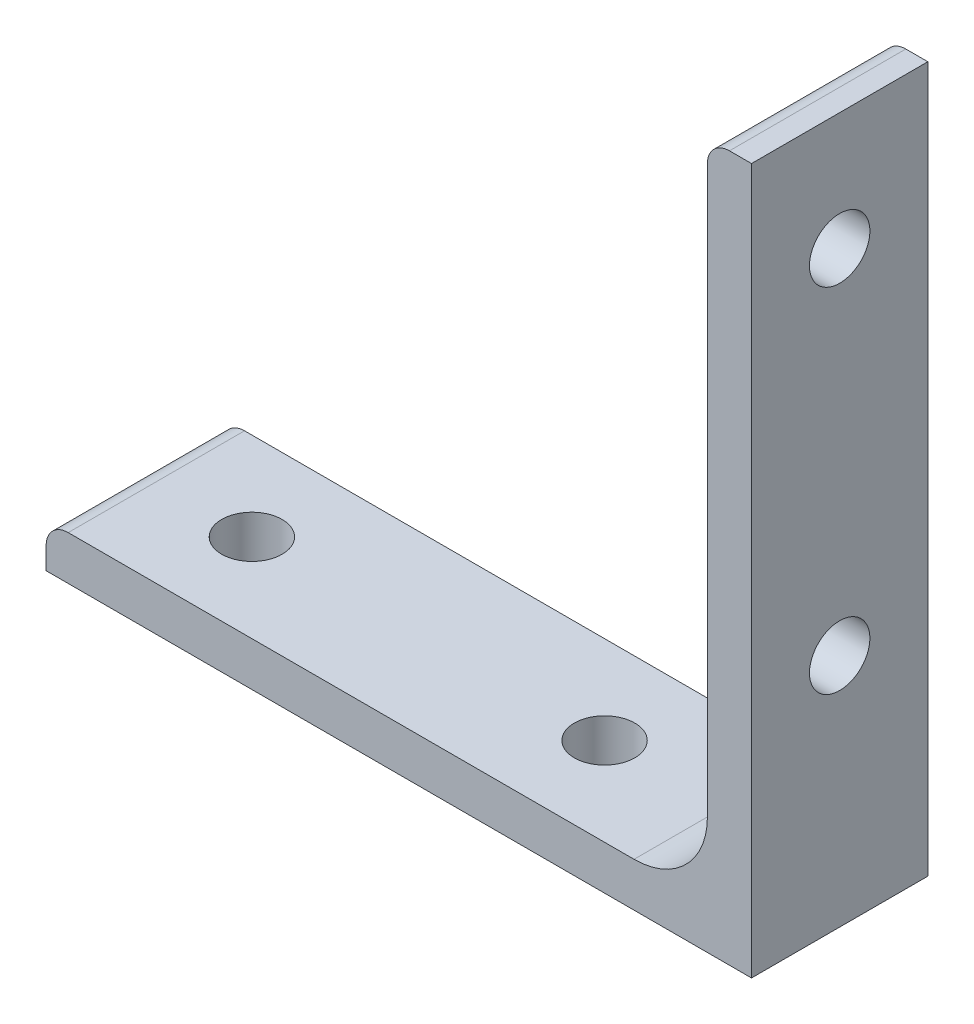
ISO-10303-21;
HEADER;
FILE_DESCRIPTION(('STEP AP214'),'2;1');
FILE_NAME('part.step','',(''),(''),'','','');
FILE_SCHEMA(('AUTOMOTIVE_DESIGN { 1 0 10303 214 1 1 1 1 }'));
ENDSEC;
DATA;
#1=APPLICATION_CONTEXT('core data for automotive mechanical design processes');
#2=APPLICATION_PROTOCOL_DEFINITION('international standard','automotive_design',2000,#1);
#3=PRODUCT_CONTEXT('',#1,'mechanical');
#4=PRODUCT('Part','Part','',(#3));
#5=PRODUCT_RELATED_PRODUCT_CATEGORY('part','',(#4));
#6=PRODUCT_DEFINITION_FORMATION('','',#4);
#7=PRODUCT_DEFINITION_CONTEXT('part definition',#1,'design');
#8=PRODUCT_DEFINITION('design','',#6,#7);
#9=PRODUCT_DEFINITION_SHAPE('','',#8);
#10=(LENGTH_UNIT() NAMED_UNIT(*) SI_UNIT(.MILLI.,.METRE.));
#11=(NAMED_UNIT(*) PLANE_ANGLE_UNIT() SI_UNIT($,.RADIAN.));
#12=(NAMED_UNIT(*) SI_UNIT($,.STERADIAN.) SOLID_ANGLE_UNIT());
#13=UNCERTAINTY_MEASURE_WITH_UNIT(LENGTH_MEASURE(1.E-05),#10,'distance_accuracy_value','');
#14=(GEOMETRIC_REPRESENTATION_CONTEXT(3) GLOBAL_UNCERTAINTY_ASSIGNED_CONTEXT((#13)) GLOBAL_UNIT_ASSIGNED_CONTEXT((#10,
#11,#12)) REPRESENTATION_CONTEXT('',''));
#15=CARTESIAN_POINT('',(0.,0.,0.));
#16=DIRECTION('',(0.,0.,1.));
#17=DIRECTION('',(1.,0.,0.));
#18=AXIS2_PLACEMENT_3D('',#15,#16,#17);
#19=CARTESIAN_POINT('',(-38.1,-35.71875,9.525));
#20=DIRECTION('',(1.,0.,0.));
#21=DIRECTION('',(0.,0.,-1.));
#22=AXIS2_PLACEMENT_3D('',#19,#20,#21);
#23=PLANE('',#22);
#24=DIRECTION('',(0.,-1.,0.));
#25=VECTOR('',#24,1.);
#26=CARTESIAN_POINT('',(-38.1,-35.71875,-9.525));
#27=LINE('',#26,#25);
#28=CARTESIAN_POINT('',(-38.1,-35.71875,-9.525));
#29=VERTEX_POINT('',#28);
#30=CARTESIAN_POINT('',(-38.1,-38.1,-9.525));
#31=VERTEX_POINT('',#30);
#32=EDGE_CURVE('E147',#29,#31,#27,.T.);
#33=ORIENTED_EDGE('',*,*,#32,.T.);
#34=DIRECTION('',(0.,0.,-1.));
#35=VECTOR('',#34,1.);
#36=CARTESIAN_POINT('',(-38.1,-38.1,9.525));
#37=LINE('',#36,#35);
#38=CARTESIAN_POINT('',(-38.1,-38.1,9.525));
#39=VERTEX_POINT('',#38);
#40=EDGE_CURVE('E11',#39,#31,#37,.T.);
#41=ORIENTED_EDGE('',*,*,#40,.F.);
#42=DIRECTION('',(0.,-1.,0.));
#43=VECTOR('',#42,1.);
#44=CARTESIAN_POINT('',(-38.1,-35.71875,9.525));
#45=LINE('',#44,#43);
#46=CARTESIAN_POINT('',(-38.1,-35.71875,9.525));
#47=VERTEX_POINT('',#46);
#48=EDGE_CURVE('E173',#47,#39,#45,.T.);
#49=ORIENTED_EDGE('',*,*,#48,.F.);
#50=DIRECTION('',(0.,0.,-1.));
#51=VECTOR('',#50,1.);
#52=CARTESIAN_POINT('',(-38.1,-35.71875,9.525));
#53=LINE('',#52,#51);
#54=EDGE_CURVE('E143',#47,#29,#53,.T.);
#55=ORIENTED_EDGE('',*,*,#54,.T.);
#56=EDGE_LOOP('',(#33,#41,#49,#55));
#57=FACE_BOUND('',#56,.T.);
#58=ADVANCED_FACE('F40',(#57),#23,.F.);
#59=CARTESIAN_POINT('',(-38.1,-38.1,9.525));
#60=DIRECTION('',(0.,1.,0.));
#61=DIRECTION('',(-1.,0.,0.));
#62=AXIS2_PLACEMENT_3D('',#59,#60,#61);
#63=PLANE('',#62);
#64=CARTESIAN_POINT('',(12.7,-38.1,0.));
#65=DIRECTION('',(0.,1.,0.));
#66=DIRECTION('',(0.,0.,1.));
#67=AXIS2_PLACEMENT_3D('',#64,#65,#66);
#68=CIRCLE('',#67,3.2639);
#69=CARTESIAN_POINT('',(12.7,-38.1,3.2639));
#70=VERTEX_POINT('',#69);
#71=EDGE_CURVE('E234',#70,#70,#68,.T.);
#72=ORIENTED_EDGE('',*,*,#71,.T.);
#73=EDGE_LOOP('',(#72));
#74=FACE_BOUND('',#73,.T.);
#75=CARTESIAN_POINT('',(-25.4,-38.1,0.));
#76=DIRECTION('',(0.,1.,0.));
#77=DIRECTION('',(0.,0.,1.));
#78=AXIS2_PLACEMENT_3D('',#75,#76,#77);
#79=CIRCLE('',#78,3.2639);
#80=CARTESIAN_POINT('',(-25.4,-38.1,3.2639));
#81=VERTEX_POINT('',#80);
#82=EDGE_CURVE('E152',#81,#81,#79,.T.);
#83=ORIENTED_EDGE('',*,*,#82,.T.);
#84=EDGE_LOOP('',(#83));
#85=FACE_BOUND('',#84,.T.);
#86=DIRECTION('',(1.,0.,0.));
#87=VECTOR('',#86,1.);
#88=CARTESIAN_POINT('',(-38.1,-38.1,-9.525));
#89=LINE('',#88,#87);
#90=CARTESIAN_POINT('',(38.1,-38.1,-9.525));
#91=VERTEX_POINT('',#90);
#92=EDGE_CURVE('E151',#31,#91,#89,.T.);
#93=ORIENTED_EDGE('',*,*,#92,.T.);
#94=DIRECTION('',(0.,0.,-1.));
#95=VECTOR('',#94,1.);
#96=CARTESIAN_POINT('',(38.1,-38.1,9.525));
#97=LINE('',#96,#95);
#98=CARTESIAN_POINT('',(38.1,-38.1,9.525));
#99=VERTEX_POINT('',#98);
#100=EDGE_CURVE('E49',#99,#91,#97,.T.);
#101=ORIENTED_EDGE('',*,*,#100,.F.);
#102=DIRECTION('',(1.,0.,0.));
#103=VECTOR('',#102,1.);
#104=CARTESIAN_POINT('',(-38.1,-38.1,9.525));
#105=LINE('',#104,#103);
#106=EDGE_CURVE('E103',#39,#99,#105,.T.);
#107=ORIENTED_EDGE('',*,*,#106,.F.);
#108=ORIENTED_EDGE('',*,*,#40,.T.);
#109=EDGE_LOOP('',(#93,#101,#107,#108));
#110=FACE_BOUND('',#109,.T.);
#111=ADVANCED_FACE('F283',(#74,#85,#110),#63,.F.);
#112=CARTESIAN_POINT('',(38.1,-38.1,9.525));
#113=DIRECTION('',(-1.,0.,0.));
#114=DIRECTION('',(0.,-1.,0.));
#115=AXIS2_PLACEMENT_3D('',#112,#113,#114);
#116=PLANE('',#115);
#117=CARTESIAN_POINT('',(38.1,-12.7,0.));
#118=DIRECTION('',(-1.,0.,0.));
#119=DIRECTION('',(0.,0.,1.));
#120=AXIS2_PLACEMENT_3D('',#117,#118,#119);
#121=CIRCLE('',#120,3.2639);
#122=CARTESIAN_POINT('',(38.1,-12.7,3.2639));
#123=VERTEX_POINT('',#122);
#124=EDGE_CURVE('E250',#123,#123,#121,.T.);
#125=ORIENTED_EDGE('',*,*,#124,.T.);
#126=EDGE_LOOP('',(#125));
#127=FACE_BOUND('',#126,.T.);
#128=CARTESIAN_POINT('',(38.1,25.4,0.));
#129=DIRECTION('',(-1.,0.,0.));
#130=DIRECTION('',(0.,0.,1.));
#131=AXIS2_PLACEMENT_3D('',#128,#129,#130);
#132=CIRCLE('',#131,3.2639);
#133=CARTESIAN_POINT('',(38.1,25.4,3.2639));
#134=VERTEX_POINT('',#133);
#135=EDGE_CURVE('E242',#134,#134,#132,.T.);
#136=ORIENTED_EDGE('',*,*,#135,.T.);
#137=EDGE_LOOP('',(#136));
#138=FACE_BOUND('',#137,.T.);
#139=DIRECTION('',(0.,1.,0.));
#140=VECTOR('',#139,1.);
#141=CARTESIAN_POINT('',(38.1,-38.1,-9.525));
#142=LINE('',#141,#140);
#143=CARTESIAN_POINT('',(38.1,38.1,-9.525));
#144=VERTEX_POINT('',#143);
#145=EDGE_CURVE('E155',#91,#144,#142,.T.);
#146=ORIENTED_EDGE('',*,*,#145,.T.);
#147=DIRECTION('',(0.,0.,-1.));
#148=VECTOR('',#147,1.);
#149=CARTESIAN_POINT('',(38.1,38.1,9.525));
#150=LINE('',#149,#148);
#151=CARTESIAN_POINT('',(38.1,38.1,9.525));
#152=VERTEX_POINT('',#151);
#153=EDGE_CURVE('E188',#152,#144,#150,.T.);
#154=ORIENTED_EDGE('',*,*,#153,.F.);
#155=DIRECTION('',(0.,1.,0.));
#156=VECTOR('',#155,1.);
#157=CARTESIAN_POINT('',(38.1,-38.1,9.525));
#158=LINE('',#157,#156);
#159=EDGE_CURVE('E198',#99,#152,#158,.T.);
#160=ORIENTED_EDGE('',*,*,#159,.F.);
#161=ORIENTED_EDGE('',*,*,#100,.T.);
#162=EDGE_LOOP('',(#146,#154,#160,#161));
#163=FACE_BOUND('',#162,.T.);
#164=ADVANCED_FACE('F196',(#127,#138,#163),#116,.F.);
#165=CARTESIAN_POINT('',(35.71875,38.1,9.525));
#166=DIRECTION('',(0.,-1.,0.));
#167=DIRECTION('',(1.,0.,0.));
#168=AXIS2_PLACEMENT_3D('',#165,#166,#167);
#169=PLANE('',#168);
#170=DIRECTION('',(-1.,0.,0.));
#171=VECTOR('',#170,1.);
#172=CARTESIAN_POINT('',(35.71875,38.1,-9.525));
#173=LINE('',#172,#171);
#174=CARTESIAN_POINT('',(35.71875,38.1,-9.525));
#175=VERTEX_POINT('',#174);
#176=EDGE_CURVE('E158',#144,#175,#173,.T.);
#177=ORIENTED_EDGE('',*,*,#176,.T.);
#178=DIRECTION('',(0.,0.,-1.));
#179=VECTOR('',#178,1.);
#180=CARTESIAN_POINT('',(35.71875,38.1,9.525));
#181=LINE('',#180,#179);
#182=CARTESIAN_POINT('',(35.71875,38.1,9.525));
#183=VERTEX_POINT('',#182);
#184=EDGE_CURVE('E184',#183,#175,#181,.T.);
#185=ORIENTED_EDGE('',*,*,#184,.F.);
#186=DIRECTION('',(-1.,0.,0.));
#187=VECTOR('',#186,1.);
#188=CARTESIAN_POINT('',(35.71875,38.1,9.525));
#189=LINE('',#188,#187);
#190=EDGE_CURVE('E215',#152,#183,#189,.T.);
#191=ORIENTED_EDGE('',*,*,#190,.F.);
#192=ORIENTED_EDGE('',*,*,#153,.T.);
#193=EDGE_LOOP('',(#177,#185,#191,#192));
#194=FACE_BOUND('',#193,.T.);
#195=ADVANCED_FACE('F207',(#194),#169,.F.);
#196=CARTESIAN_POINT('',(35.71875,35.71875,9.525));
#197=DIRECTION('',(0.,0.,-1.));
#198=DIRECTION('',(-1.,0.,0.));
#199=AXIS2_PLACEMENT_3D('',#196,#197,#198);
#200=CYLINDRICAL_SURFACE('',#199,2.38124999999999);
#201=CARTESIAN_POINT('',(35.71875,35.71875,-9.525));
#202=DIRECTION('',(0.,0.,1.));
#203=DIRECTION('',(-1.,0.,0.));
#204=AXIS2_PLACEMENT_3D('',#201,#202,#203);
#205=CIRCLE('',#204,2.38124999999999);
#206=CARTESIAN_POINT('',(33.3375,35.71875,-9.525));
#207=VERTEX_POINT('',#206);
#208=EDGE_CURVE('E161',#175,#207,#205,.T.);
#209=ORIENTED_EDGE('',*,*,#208,.T.);
#210=DIRECTION('',(0.,0.,-1.));
#211=VECTOR('',#210,1.);
#212=CARTESIAN_POINT('',(33.3375,35.71875,9.525));
#213=LINE('',#212,#211);
#214=CARTESIAN_POINT('',(33.3375,35.71875,9.525));
#215=VERTEX_POINT('',#214);
#216=EDGE_CURVE('E180',#215,#207,#213,.T.);
#217=ORIENTED_EDGE('',*,*,#216,.F.);
#218=CARTESIAN_POINT('',(35.71875,35.71875,9.525));
#219=DIRECTION('',(0.,0.,1.));
#220=DIRECTION('',(-1.,0.,0.));
#221=AXIS2_PLACEMENT_3D('',#218,#219,#220);
#222=CIRCLE('',#221,2.38124999999999);
#223=EDGE_CURVE('E213',#183,#215,#222,.T.);
#224=ORIENTED_EDGE('',*,*,#223,.F.);
#225=ORIENTED_EDGE('',*,*,#184,.T.);
#226=EDGE_LOOP('',(#209,#217,#224,#225));
#227=FACE_BOUND('',#226,.T.);
#228=ADVANCED_FACE('F211',(#227),#200,.T.);
#229=CARTESIAN_POINT('',(33.3375,35.71875,9.525));
#230=DIRECTION('',(1.,0.,0.));
#231=DIRECTION('',(0.,1.,0.));
#232=AXIS2_PLACEMENT_3D('',#229,#230,#231);
#233=PLANE('',#232);
#234=CARTESIAN_POINT('',(33.3375,-12.7,0.));
#235=DIRECTION('',(-1.,0.,0.));
#236=DIRECTION('',(0.,0.,1.));
#237=AXIS2_PLACEMENT_3D('',#234,#235,#236);
#238=CIRCLE('',#237,3.2639);
#239=CARTESIAN_POINT('',(33.3375,-12.7,3.2639));
#240=VERTEX_POINT('',#239);
#241=EDGE_CURVE('E254',#240,#240,#238,.T.);
#242=ORIENTED_EDGE('',*,*,#241,.F.);
#243=EDGE_LOOP('',(#242));
#244=FACE_BOUND('',#243,.T.);
#245=CARTESIAN_POINT('',(33.3375,25.4,0.));
#246=DIRECTION('',(-1.,0.,0.));
#247=DIRECTION('',(0.,0.,1.));
#248=AXIS2_PLACEMENT_3D('',#245,#246,#247);
#249=CIRCLE('',#248,3.2639);
#250=CARTESIAN_POINT('',(33.3375,25.4,3.2639));
#251=VERTEX_POINT('',#250);
#252=EDGE_CURVE('E246',#251,#251,#249,.T.);
#253=ORIENTED_EDGE('',*,*,#252,.F.);
#254=EDGE_LOOP('',(#253));
#255=FACE_BOUND('',#254,.T.);
#256=DIRECTION('',(0.,-1.,0.));
#257=VECTOR('',#256,1.);
#258=CARTESIAN_POINT('',(33.3375,35.71875,-9.525));
#259=LINE('',#258,#257);
#260=CARTESIAN_POINT('',(33.3375,-25.4127,-9.525));
#261=VERTEX_POINT('',#260);
#262=EDGE_CURVE('E164',#207,#261,#259,.T.);
#263=ORIENTED_EDGE('',*,*,#262,.T.);
#264=DIRECTION('',(0.,0.,-1.));
#265=VECTOR('',#264,1.);
#266=CARTESIAN_POINT('',(33.3375,-25.4127,9.525));
#267=LINE('',#266,#265);
#268=CARTESIAN_POINT('',(33.3375,-25.4127,9.525));
#269=VERTEX_POINT('',#268);
#270=EDGE_CURVE('E136',#269,#261,#267,.T.);
#271=ORIENTED_EDGE('',*,*,#270,.F.);
#272=DIRECTION('',(0.,-1.,0.));
#273=VECTOR('',#272,1.);
#274=CARTESIAN_POINT('',(33.3375,35.71875,9.525));
#275=LINE('',#274,#273);
#276=EDGE_CURVE('E125',#215,#269,#275,.T.);
#277=ORIENTED_EDGE('',*,*,#276,.F.);
#278=ORIENTED_EDGE('',*,*,#216,.T.);
#279=EDGE_LOOP('',(#263,#271,#277,#278));
#280=FACE_BOUND('',#279,.T.);
#281=ADVANCED_FACE('F261',(#244,#255,#280),#233,.F.);
#282=CARTESIAN_POINT('',(25.4127,-25.4127,9.525));
#283=DIRECTION('',(0.,0.,-1.));
#284=DIRECTION('',(-1.,0.,0.));
#285=AXIS2_PLACEMENT_3D('',#282,#283,#284);
#286=CYLINDRICAL_SURFACE('',#285,7.9248);
#287=CARTESIAN_POINT('',(25.4127,-25.4127,-9.525));
#288=DIRECTION('',(0.,0.,-1.));
#289=DIRECTION('',(-1.,0.,0.));
#290=AXIS2_PLACEMENT_3D('',#287,#288,#289);
#291=CIRCLE('',#290,7.9248);
#292=CARTESIAN_POINT('',(25.4127,-33.3375,-9.525));
#293=VERTEX_POINT('',#292);
#294=EDGE_CURVE('E134',#261,#293,#291,.T.);
#295=ORIENTED_EDGE('',*,*,#294,.T.);
#296=DIRECTION('',(0.,0.,-1.));
#297=VECTOR('',#296,1.);
#298=CARTESIAN_POINT('',(25.4127,-33.3375,9.525));
#299=LINE('',#298,#297);
#300=CARTESIAN_POINT('',(25.4127,-33.3375,9.525));
#301=VERTEX_POINT('',#300);
#302=EDGE_CURVE('E131',#301,#293,#299,.T.);
#303=ORIENTED_EDGE('',*,*,#302,.F.);
#304=CARTESIAN_POINT('',(25.4127,-25.4127,9.525));
#305=DIRECTION('',(0.,0.,-1.));
#306=DIRECTION('',(-1.,0.,0.));
#307=AXIS2_PLACEMENT_3D('',#304,#305,#306);
#308=CIRCLE('',#307,7.9248);
#309=EDGE_CURVE('E119',#269,#301,#308,.T.);
#310=ORIENTED_EDGE('',*,*,#309,.F.);
#311=ORIENTED_EDGE('',*,*,#270,.T.);
#312=EDGE_LOOP('',(#295,#303,#310,#311));
#313=FACE_BOUND('',#312,.T.);
#314=ADVANCED_FACE('F132',(#313),#286,.F.);
#315=CARTESIAN_POINT('',(25.4127,-33.3375,9.525));
#316=DIRECTION('',(0.,-1.,0.));
#317=DIRECTION('',(0.,0.,-1.));
#318=AXIS2_PLACEMENT_3D('',#315,#316,#317);
#319=PLANE('',#318);
#320=CARTESIAN_POINT('',(12.7,-33.3375,0.));
#321=DIRECTION('',(0.,1.,0.));
#322=DIRECTION('',(0.,0.,1.));
#323=AXIS2_PLACEMENT_3D('',#320,#321,#322);
#324=CIRCLE('',#323,3.2639);
#325=CARTESIAN_POINT('',(12.7,-33.3375,3.2639));
#326=VERTEX_POINT('',#325);
#327=EDGE_CURVE('E238',#326,#326,#324,.T.);
#328=ORIENTED_EDGE('',*,*,#327,.F.);
#329=EDGE_LOOP('',(#328));
#330=FACE_BOUND('',#329,.T.);
#331=CARTESIAN_POINT('',(-25.4,-33.3375,0.));
#332=DIRECTION('',(0.,1.,0.));
#333=DIRECTION('',(0.,0.,1.));
#334=AXIS2_PLACEMENT_3D('',#331,#332,#333);
#335=CIRCLE('',#334,3.2639);
#336=CARTESIAN_POINT('',(-25.4,-33.3375,3.2639));
#337=VERTEX_POINT('',#336);
#338=EDGE_CURVE('E230',#337,#337,#335,.T.);
#339=ORIENTED_EDGE('',*,*,#338,.F.);
#340=EDGE_LOOP('',(#339));
#341=FACE_BOUND('',#340,.T.);
#342=DIRECTION('',(-1.,0.,0.));
#343=VECTOR('',#342,1.);
#344=CARTESIAN_POINT('',(25.4127,-33.3375,-9.525));
#345=LINE('',#344,#343);
#346=CARTESIAN_POINT('',(-35.71875,-33.3375,-9.525));
#347=VERTEX_POINT('',#346);
#348=EDGE_CURVE('E89',#293,#347,#345,.T.);
#349=ORIENTED_EDGE('',*,*,#348,.T.);
#350=DIRECTION('',(0.,0.,-1.));
#351=VECTOR('',#350,1.);
#352=CARTESIAN_POINT('',(-35.71875,-33.3375,9.525));
#353=LINE('',#352,#351);
#354=CARTESIAN_POINT('',(-35.71875,-33.3375,9.525));
#355=VERTEX_POINT('',#354);
#356=EDGE_CURVE('E137',#355,#347,#353,.T.);
#357=ORIENTED_EDGE('',*,*,#356,.F.);
#358=DIRECTION('',(-1.,0.,0.));
#359=VECTOR('',#358,1.);
#360=CARTESIAN_POINT('',(25.4127,-33.3375,9.525));
#361=LINE('',#360,#359);
#362=EDGE_CURVE('E123',#301,#355,#361,.T.);
#363=ORIENTED_EDGE('',*,*,#362,.F.);
#364=ORIENTED_EDGE('',*,*,#302,.T.);
#365=EDGE_LOOP('',(#349,#357,#363,#364));
#366=FACE_BOUND('',#365,.T.);
#367=ADVANCED_FACE('F139',(#330,#341,#366),#319,.F.);
#368=CARTESIAN_POINT('',(-35.71875,-35.71875,9.525));
#369=DIRECTION('',(0.,0.,-1.));
#370=DIRECTION('',(-1.,0.,0.));
#371=AXIS2_PLACEMENT_3D('',#368,#369,#370);
#372=CYLINDRICAL_SURFACE('',#371,2.38125);
#373=CARTESIAN_POINT('',(-35.71875,-35.71875,-9.525));
#374=DIRECTION('',(0.,0.,1.));
#375=DIRECTION('',(-1.,0.,0.));
#376=AXIS2_PLACEMENT_3D('',#373,#374,#375);
#377=CIRCLE('',#376,2.38125);
#378=EDGE_CURVE('E95',#347,#29,#377,.T.);
#379=ORIENTED_EDGE('',*,*,#378,.T.);
#380=ORIENTED_EDGE('',*,*,#54,.F.);
#381=CARTESIAN_POINT('',(-35.71875,-35.71875,9.525));
#382=DIRECTION('',(0.,0.,1.));
#383=DIRECTION('',(-1.,0.,0.));
#384=AXIS2_PLACEMENT_3D('',#381,#382,#383);
#385=CIRCLE('',#384,2.38125);
#386=EDGE_CURVE('E57',#355,#47,#385,.T.);
#387=ORIENTED_EDGE('',*,*,#386,.F.);
#388=ORIENTED_EDGE('',*,*,#356,.T.);
#389=EDGE_LOOP('',(#379,#380,#387,#388));
#390=FACE_BOUND('',#389,.T.);
#391=ADVANCED_FACE('F270',(#390),#372,.T.);
#392=CARTESIAN_POINT('',(35.71875,35.71875,9.525));
#393=DIRECTION('',(0.,0.,-1.));
#394=DIRECTION('',(-1.,0.,0.));
#395=AXIS2_PLACEMENT_3D('',#392,#393,#394);
#396=PLANE('',#395);
#397=ORIENTED_EDGE('',*,*,#48,.T.);
#398=ORIENTED_EDGE('',*,*,#106,.T.);
#399=ORIENTED_EDGE('',*,*,#159,.T.);
#400=ORIENTED_EDGE('',*,*,#190,.T.);
#401=ORIENTED_EDGE('',*,*,#223,.T.);
#402=ORIENTED_EDGE('',*,*,#276,.T.);
#403=ORIENTED_EDGE('',*,*,#309,.T.);
#404=ORIENTED_EDGE('',*,*,#362,.T.);
#405=ORIENTED_EDGE('',*,*,#386,.T.);
#406=EDGE_LOOP('',(#397,#398,#399,#400,#401,#402,#403,#404,#405));
#407=FACE_BOUND('',#406,.T.);
#408=ADVANCED_FACE('F121',(#407),#396,.F.);
#409=CARTESIAN_POINT('',(35.71875,35.71875,-9.525));
#410=DIRECTION('',(0.,0.,-1.));
#411=DIRECTION('',(-1.,0.,0.));
#412=AXIS2_PLACEMENT_3D('',#409,#410,#411);
#413=PLANE('',#412);
#414=ORIENTED_EDGE('',*,*,#32,.F.);
#415=ORIENTED_EDGE('',*,*,#378,.F.);
#416=ORIENTED_EDGE('',*,*,#348,.F.);
#417=ORIENTED_EDGE('',*,*,#294,.F.);
#418=ORIENTED_EDGE('',*,*,#262,.F.);
#419=ORIENTED_EDGE('',*,*,#208,.F.);
#420=ORIENTED_EDGE('',*,*,#176,.F.);
#421=ORIENTED_EDGE('',*,*,#145,.F.);
#422=ORIENTED_EDGE('',*,*,#92,.F.);
#423=EDGE_LOOP('',(#414,#415,#416,#417,#418,#419,#420,#421,#422));
#424=FACE_BOUND('',#423,.T.);
#425=ADVANCED_FACE('F202',(#424),#413,.T.);
#426=CARTESIAN_POINT('',(-25.4,-33.3375,0.));
#427=DIRECTION('',(0.,1.,0.));
#428=DIRECTION('',(0.,0.,1.));
#429=AXIS2_PLACEMENT_3D('',#426,#427,#428);
#430=CYLINDRICAL_SURFACE('',#429,3.2639);
#431=ORIENTED_EDGE('',*,*,#82,.F.);
#432=EDGE_LOOP('',(#431));
#433=FACE_BOUND('',#432,.T.);
#434=ORIENTED_EDGE('',*,*,#338,.T.);
#435=EDGE_LOOP('',(#434));
#436=FACE_BOUND('',#435,.T.);
#437=ADVANCED_FACE('F316',(#433,#436),#430,.F.);
#438=CARTESIAN_POINT('',(12.7,-33.3375,0.));
#439=DIRECTION('',(0.,1.,0.));
#440=DIRECTION('',(0.,0.,1.));
#441=AXIS2_PLACEMENT_3D('',#438,#439,#440);
#442=CYLINDRICAL_SURFACE('',#441,3.2639);
#443=ORIENTED_EDGE('',*,*,#71,.F.);
#444=EDGE_LOOP('',(#443));
#445=FACE_BOUND('',#444,.T.);
#446=ORIENTED_EDGE('',*,*,#327,.T.);
#447=EDGE_LOOP('',(#446));
#448=FACE_BOUND('',#447,.T.);
#449=ADVANCED_FACE('F321',(#445,#448),#442,.F.);
#450=CARTESIAN_POINT('',(33.3375,25.4,0.));
#451=DIRECTION('',(-1.,0.,0.));
#452=DIRECTION('',(0.,0.,1.));
#453=AXIS2_PLACEMENT_3D('',#450,#451,#452);
#454=CYLINDRICAL_SURFACE('',#453,3.2639);
#455=ORIENTED_EDGE('',*,*,#135,.F.);
#456=EDGE_LOOP('',(#455));
#457=FACE_BOUND('',#456,.T.);
#458=ORIENTED_EDGE('',*,*,#252,.T.);
#459=EDGE_LOOP('',(#458));
#460=FACE_BOUND('',#459,.T.);
#461=ADVANCED_FACE('F332',(#457,#460),#454,.F.);
#462=CARTESIAN_POINT('',(33.3375,-12.7,0.));
#463=DIRECTION('',(-1.,0.,0.));
#464=DIRECTION('',(0.,0.,1.));
#465=AXIS2_PLACEMENT_3D('',#462,#463,#464);
#466=CYLINDRICAL_SURFACE('',#465,3.2639);
#467=ORIENTED_EDGE('',*,*,#124,.F.);
#468=EDGE_LOOP('',(#467));
#469=FACE_BOUND('',#468,.T.);
#470=ORIENTED_EDGE('',*,*,#241,.T.);
#471=EDGE_LOOP('',(#470));
#472=FACE_BOUND('',#471,.T.);
#473=ADVANCED_FACE('F259',(#469,#472),#466,.F.);
#474=CLOSED_SHELL('',(#58,#111,#164,#195,#228,#281,#314,#367,#391,#408,#425,#437,#449,#461,#473));
#475=MANIFOLD_SOLID_BREP('B2',#474);
#476=ADVANCED_BREP_SHAPE_REPRESENTATION('',(#18,#475),#14);
#477=SHAPE_DEFINITION_REPRESENTATION(#9,#476);
ENDSEC;
END-ISO-10303-21;
